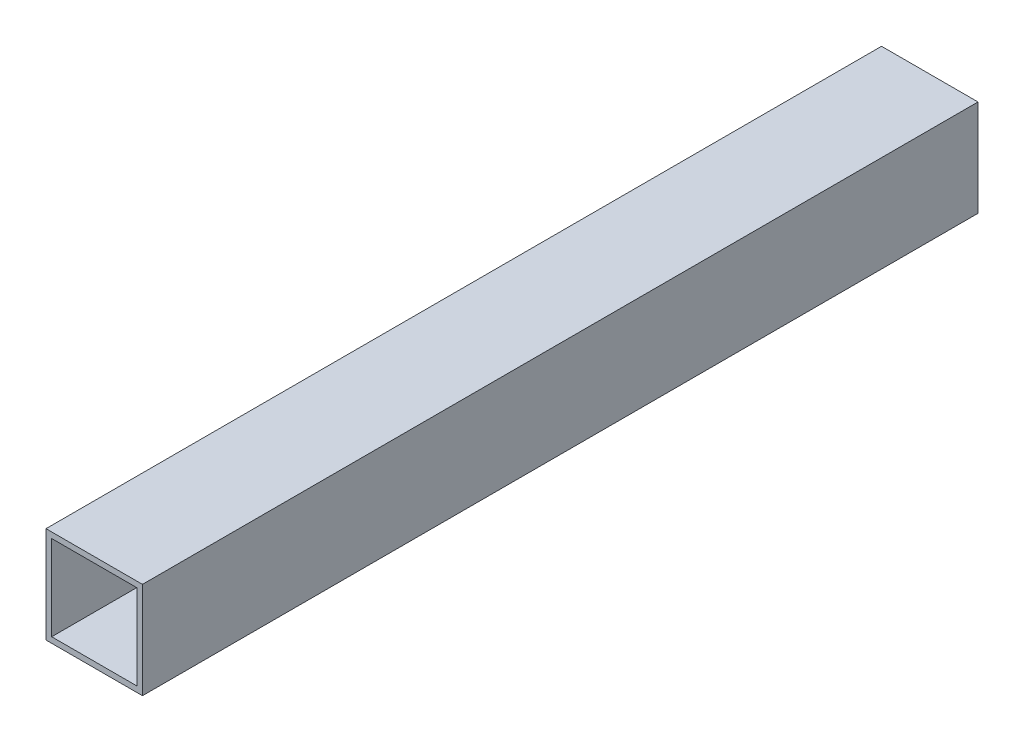
ISO-10303-21;
HEADER;
FILE_DESCRIPTION(('STEP AP214'),'2;1');
FILE_NAME('part.step','',(''),(''),'','','');
FILE_SCHEMA(('AUTOMOTIVE_DESIGN { 1 0 10303 214 1 1 1 1 }'));
ENDSEC;
DATA;
#1=APPLICATION_CONTEXT('core data for automotive mechanical design processes');
#2=APPLICATION_PROTOCOL_DEFINITION('international standard','automotive_design',2000,#1);
#3=PRODUCT_CONTEXT('',#1,'mechanical');
#4=PRODUCT('Part','Part','',(#3));
#5=PRODUCT_RELATED_PRODUCT_CATEGORY('part','',(#4));
#6=PRODUCT_DEFINITION_FORMATION('','',#4);
#7=PRODUCT_DEFINITION_CONTEXT('part definition',#1,'design');
#8=PRODUCT_DEFINITION('design','',#6,#7);
#9=PRODUCT_DEFINITION_SHAPE('','',#8);
#10=(LENGTH_UNIT() NAMED_UNIT(*) SI_UNIT(.MILLI.,.METRE.));
#11=(NAMED_UNIT(*) PLANE_ANGLE_UNIT() SI_UNIT($,.RADIAN.));
#12=(NAMED_UNIT(*) SI_UNIT($,.STERADIAN.) SOLID_ANGLE_UNIT());
#13=UNCERTAINTY_MEASURE_WITH_UNIT(LENGTH_MEASURE(1.E-05),#10,'distance_accuracy_value','');
#14=(GEOMETRIC_REPRESENTATION_CONTEXT(3) GLOBAL_UNCERTAINTY_ASSIGNED_CONTEXT((#13)) GLOBAL_UNIT_ASSIGNED_CONTEXT((#10,
#11,#12)) REPRESENTATION_CONTEXT('',''));
#15=CARTESIAN_POINT('',(0.,0.,0.));
#16=DIRECTION('',(0.,0.,1.));
#17=DIRECTION('',(1.,0.,0.));
#18=AXIS2_PLACEMENT_3D('',#15,#16,#17);
#19=CARTESIAN_POINT('',(0.,0.,220.));
#20=DIRECTION('',(0.,0.,-1.));
#21=DIRECTION('',(-1.,0.,0.));
#22=AXIS2_PLACEMENT_3D('',#19,#20,#21);
#23=PLANE('',#22);
#24=DIRECTION('',(0.,1.,0.));
#25=VECTOR('',#24,1.);
#26=CARTESIAN_POINT('',(12.7,-12.7,220.));
#27=LINE('',#26,#25);
#28=CARTESIAN_POINT('',(12.7,-12.7,220.));
#29=VERTEX_POINT('',#28);
#30=CARTESIAN_POINT('',(12.7,12.7,220.));
#31=VERTEX_POINT('',#30);
#32=EDGE_CURVE('E133',#29,#31,#27,.T.);
#33=ORIENTED_EDGE('',*,*,#32,.T.);
#34=DIRECTION('',(-1.,0.,0.));
#35=VECTOR('',#34,1.);
#36=CARTESIAN_POINT('',(-12.7,12.7,220.));
#37=LINE('',#36,#35);
#38=CARTESIAN_POINT('',(-12.7,12.7,220.));
#39=VERTEX_POINT('',#38);
#40=EDGE_CURVE('E136',#31,#39,#37,.T.);
#41=ORIENTED_EDGE('',*,*,#40,.T.);
#42=DIRECTION('',(0.,-1.,0.));
#43=VECTOR('',#42,1.);
#44=CARTESIAN_POINT('',(-12.7,-12.7,220.));
#45=LINE('',#44,#43);
#46=CARTESIAN_POINT('',(-12.7,-12.7,220.));
#47=VERTEX_POINT('',#46);
#48=EDGE_CURVE('E139',#39,#47,#45,.T.);
#49=ORIENTED_EDGE('',*,*,#48,.T.);
#50=DIRECTION('',(1.,0.,0.));
#51=VECTOR('',#50,1.);
#52=CARTESIAN_POINT('',(-12.7,-12.7,220.));
#53=LINE('',#52,#51);
#54=EDGE_CURVE('E141',#47,#29,#53,.T.);
#55=ORIENTED_EDGE('',*,*,#54,.T.);
#56=EDGE_LOOP('',(#33,#41,#49,#55));
#57=FACE_BOUND('',#56,.T.);
#58=DIRECTION('',(0.,1.,0.));
#59=VECTOR('',#58,1.);
#60=CARTESIAN_POINT('',(11.2,-11.2,220.));
#61=LINE('',#60,#59);
#62=CARTESIAN_POINT('',(11.2,-11.2,220.));
#63=VERTEX_POINT('',#62);
#64=CARTESIAN_POINT('',(11.2,11.2,220.));
#65=VERTEX_POINT('',#64);
#66=EDGE_CURVE('E97',#63,#65,#61,.T.);
#67=ORIENTED_EDGE('',*,*,#66,.F.);
#68=DIRECTION('',(1.,0.,0.));
#69=VECTOR('',#68,1.);
#70=CARTESIAN_POINT('',(-11.2,-11.2,220.));
#71=LINE('',#70,#69);
#72=CARTESIAN_POINT('',(-11.2,-11.2,220.));
#73=VERTEX_POINT('',#72);
#74=EDGE_CURVE('E119',#73,#63,#71,.T.);
#75=ORIENTED_EDGE('',*,*,#74,.F.);
#76=DIRECTION('',(0.,-1.,0.));
#77=VECTOR('',#76,1.);
#78=CARTESIAN_POINT('',(-11.2,-11.2,220.));
#79=LINE('',#78,#77);
#80=CARTESIAN_POINT('',(-11.2,11.2,220.));
#81=VERTEX_POINT('',#80);
#82=EDGE_CURVE('E117',#81,#73,#79,.T.);
#83=ORIENTED_EDGE('',*,*,#82,.F.);
#84=DIRECTION('',(-1.,0.,0.));
#85=VECTOR('',#84,1.);
#86=CARTESIAN_POINT('',(-11.2,11.2,220.));
#87=LINE('',#86,#85);
#88=EDGE_CURVE('E105',#65,#81,#87,.T.);
#89=ORIENTED_EDGE('',*,*,#88,.F.);
#90=EDGE_LOOP('',(#67,#75,#83,#89));
#91=FACE_BOUND('',#90,.T.);
#92=ADVANCED_FACE('F32',(#57,#91),#23,.F.);
#93=CARTESIAN_POINT('',(0.,0.,0.));
#94=DIRECTION('',(0.,0.,-1.));
#95=DIRECTION('',(-1.,0.,0.));
#96=AXIS2_PLACEMENT_3D('',#93,#94,#95);
#97=PLANE('',#96);
#98=DIRECTION('',(0.,1.,0.));
#99=VECTOR('',#98,1.);
#100=CARTESIAN_POINT('',(12.7,-12.7,0.));
#101=LINE('',#100,#99);
#102=CARTESIAN_POINT('',(12.7,-12.7,0.));
#103=VERTEX_POINT('',#102);
#104=CARTESIAN_POINT('',(12.7,12.7,0.));
#105=VERTEX_POINT('',#104);
#106=EDGE_CURVE('E113',#103,#105,#101,.T.);
#107=ORIENTED_EDGE('',*,*,#106,.F.);
#108=DIRECTION('',(1.,0.,0.));
#109=VECTOR('',#108,1.);
#110=CARTESIAN_POINT('',(-12.7,-12.7,0.));
#111=LINE('',#110,#109);
#112=CARTESIAN_POINT('',(-12.7,-12.7,0.));
#113=VERTEX_POINT('',#112);
#114=EDGE_CURVE('E137',#113,#103,#111,.T.);
#115=ORIENTED_EDGE('',*,*,#114,.F.);
#116=DIRECTION('',(0.,-1.,0.));
#117=VECTOR('',#116,1.);
#118=CARTESIAN_POINT('',(-12.7,-12.7,0.));
#119=LINE('',#118,#117);
#120=CARTESIAN_POINT('',(-12.7,12.7,0.));
#121=VERTEX_POINT('',#120);
#122=EDGE_CURVE('E148',#121,#113,#119,.T.);
#123=ORIENTED_EDGE('',*,*,#122,.F.);
#124=DIRECTION('',(-1.,0.,0.));
#125=VECTOR('',#124,1.);
#126=CARTESIAN_POINT('',(-12.7,12.7,0.));
#127=LINE('',#126,#125);
#128=EDGE_CURVE('E146',#105,#121,#127,.T.);
#129=ORIENTED_EDGE('',*,*,#128,.F.);
#130=EDGE_LOOP('',(#107,#115,#123,#129));
#131=FACE_BOUND('',#130,.T.);
#132=DIRECTION('',(1.,0.,0.));
#133=VECTOR('',#132,1.);
#134=CARTESIAN_POINT('',(-11.2,-11.2,0.));
#135=LINE('',#134,#133);
#136=CARTESIAN_POINT('',(-11.2,-11.2,0.));
#137=VERTEX_POINT('',#136);
#138=CARTESIAN_POINT('',(11.2,-11.2,0.));
#139=VERTEX_POINT('',#138);
#140=EDGE_CURVE('E106',#137,#139,#135,.T.);
#141=ORIENTED_EDGE('',*,*,#140,.T.);
#142=DIRECTION('',(0.,1.,0.));
#143=VECTOR('',#142,1.);
#144=CARTESIAN_POINT('',(11.2,-11.2,0.));
#145=LINE('',#144,#143);
#146=CARTESIAN_POINT('',(11.2,11.2,0.));
#147=VERTEX_POINT('',#146);
#148=EDGE_CURVE('E55',#139,#147,#145,.T.);
#149=ORIENTED_EDGE('',*,*,#148,.T.);
#150=DIRECTION('',(-1.,0.,0.));
#151=VECTOR('',#150,1.);
#152=CARTESIAN_POINT('',(-11.2,11.2,0.));
#153=LINE('',#152,#151);
#154=CARTESIAN_POINT('',(-11.2,11.2,0.));
#155=VERTEX_POINT('',#154);
#156=EDGE_CURVE('E112',#147,#155,#153,.T.);
#157=ORIENTED_EDGE('',*,*,#156,.T.);
#158=DIRECTION('',(0.,-1.,0.));
#159=VECTOR('',#158,1.);
#160=CARTESIAN_POINT('',(-11.2,-11.2,0.));
#161=LINE('',#160,#159);
#162=EDGE_CURVE('E125',#155,#137,#161,.T.);
#163=ORIENTED_EDGE('',*,*,#162,.T.);
#164=EDGE_LOOP('',(#141,#149,#157,#163));
#165=FACE_BOUND('',#164,.T.);
#166=ADVANCED_FACE('F166',(#131,#165),#97,.T.);
#167=CARTESIAN_POINT('',(12.7,-12.7,220.));
#168=DIRECTION('',(-1.,0.,0.));
#169=DIRECTION('',(0.,0.,1.));
#170=AXIS2_PLACEMENT_3D('',#167,#168,#169);
#171=PLANE('',#170);
#172=ORIENTED_EDGE('',*,*,#106,.T.);
#173=DIRECTION('',(0.,0.,-1.));
#174=VECTOR('',#173,1.);
#175=CARTESIAN_POINT('',(12.7,12.7,220.));
#176=LINE('',#175,#174);
#177=EDGE_CURVE('E11',#31,#105,#176,.T.);
#178=ORIENTED_EDGE('',*,*,#177,.F.);
#179=ORIENTED_EDGE('',*,*,#32,.F.);
#180=DIRECTION('',(0.,0.,-1.));
#181=VECTOR('',#180,1.);
#182=CARTESIAN_POINT('',(12.7,-12.7,220.));
#183=LINE('',#182,#181);
#184=EDGE_CURVE('E143',#29,#103,#183,.T.);
#185=ORIENTED_EDGE('',*,*,#184,.T.);
#186=EDGE_LOOP('',(#172,#178,#179,#185));
#187=FACE_BOUND('',#186,.T.);
#188=ADVANCED_FACE('F34',(#187),#171,.F.);
#189=CARTESIAN_POINT('',(-12.7,12.7,220.));
#190=DIRECTION('',(0.,-1.,0.));
#191=DIRECTION('',(1.,0.,0.));
#192=AXIS2_PLACEMENT_3D('',#189,#190,#191);
#193=PLANE('',#192);
#194=ORIENTED_EDGE('',*,*,#128,.T.);
#195=DIRECTION('',(0.,0.,-1.));
#196=VECTOR('',#195,1.);
#197=CARTESIAN_POINT('',(-12.7,12.7,220.));
#198=LINE('',#197,#196);
#199=EDGE_CURVE('E40',#39,#121,#198,.T.);
#200=ORIENTED_EDGE('',*,*,#199,.F.);
#201=ORIENTED_EDGE('',*,*,#40,.F.);
#202=ORIENTED_EDGE('',*,*,#177,.T.);
#203=EDGE_LOOP('',(#194,#200,#201,#202));
#204=FACE_BOUND('',#203,.T.);
#205=ADVANCED_FACE('F176',(#204),#193,.F.);
#206=CARTESIAN_POINT('',(-12.7,-12.7,220.));
#207=DIRECTION('',(1.,0.,0.));
#208=DIRECTION('',(0.,0.,-1.));
#209=AXIS2_PLACEMENT_3D('',#206,#207,#208);
#210=PLANE('',#209);
#211=ORIENTED_EDGE('',*,*,#122,.T.);
#212=DIRECTION('',(0.,0.,-1.));
#213=VECTOR('',#212,1.);
#214=CARTESIAN_POINT('',(-12.7,-12.7,220.));
#215=LINE('',#214,#213);
#216=EDGE_CURVE('E153',#47,#113,#215,.T.);
#217=ORIENTED_EDGE('',*,*,#216,.F.);
#218=ORIENTED_EDGE('',*,*,#48,.F.);
#219=ORIENTED_EDGE('',*,*,#199,.T.);
#220=EDGE_LOOP('',(#211,#217,#218,#219));
#221=FACE_BOUND('',#220,.T.);
#222=ADVANCED_FACE('F160',(#221),#210,.F.);
#223=CARTESIAN_POINT('',(-12.7,-12.7,220.));
#224=DIRECTION('',(0.,1.,0.));
#225=DIRECTION('',(-1.,0.,0.));
#226=AXIS2_PLACEMENT_3D('',#223,#224,#225);
#227=PLANE('',#226);
#228=ORIENTED_EDGE('',*,*,#114,.T.);
#229=ORIENTED_EDGE('',*,*,#184,.F.);
#230=ORIENTED_EDGE('',*,*,#54,.F.);
#231=ORIENTED_EDGE('',*,*,#216,.T.);
#232=EDGE_LOOP('',(#228,#229,#230,#231));
#233=FACE_BOUND('',#232,.T.);
#234=ADVANCED_FACE('F170',(#233),#227,.F.);
#235=CARTESIAN_POINT('',(11.2,-11.2,220.));
#236=DIRECTION('',(-1.,0.,0.));
#237=DIRECTION('',(0.,0.,1.));
#238=AXIS2_PLACEMENT_3D('',#235,#236,#237);
#239=PLANE('',#238);
#240=ORIENTED_EDGE('',*,*,#148,.F.);
#241=DIRECTION('',(0.,0.,-1.));
#242=VECTOR('',#241,1.);
#243=CARTESIAN_POINT('',(11.2,-11.2,220.));
#244=LINE('',#243,#242);
#245=EDGE_CURVE('E101',#63,#139,#244,.T.);
#246=ORIENTED_EDGE('',*,*,#245,.F.);
#247=ORIENTED_EDGE('',*,*,#66,.T.);
#248=DIRECTION('',(0.,0.,-1.));
#249=VECTOR('',#248,1.);
#250=CARTESIAN_POINT('',(11.2,11.2,220.));
#251=LINE('',#250,#249);
#252=EDGE_CURVE('E100',#65,#147,#251,.T.);
#253=ORIENTED_EDGE('',*,*,#252,.T.);
#254=EDGE_LOOP('',(#240,#246,#247,#253));
#255=FACE_BOUND('',#254,.T.);
#256=ADVANCED_FACE('F99',(#255),#239,.T.);
#257=CARTESIAN_POINT('',(-11.2,11.2,220.));
#258=DIRECTION('',(0.,-1.,0.));
#259=DIRECTION('',(0.,0.,-1.));
#260=AXIS2_PLACEMENT_3D('',#257,#258,#259);
#261=PLANE('',#260);
#262=ORIENTED_EDGE('',*,*,#156,.F.);
#263=ORIENTED_EDGE('',*,*,#252,.F.);
#264=ORIENTED_EDGE('',*,*,#88,.T.);
#265=DIRECTION('',(0.,0.,-1.));
#266=VECTOR('',#265,1.);
#267=CARTESIAN_POINT('',(-11.2,11.2,220.));
#268=LINE('',#267,#266);
#269=EDGE_CURVE('E114',#81,#155,#268,.T.);
#270=ORIENTED_EDGE('',*,*,#269,.T.);
#271=EDGE_LOOP('',(#262,#263,#264,#270));
#272=FACE_BOUND('',#271,.T.);
#273=ADVANCED_FACE('F109',(#272),#261,.T.);
#274=CARTESIAN_POINT('',(-11.2,-11.2,220.));
#275=DIRECTION('',(1.,0.,0.));
#276=DIRECTION('',(0.,0.,-1.));
#277=AXIS2_PLACEMENT_3D('',#274,#275,#276);
#278=PLANE('',#277);
#279=ORIENTED_EDGE('',*,*,#162,.F.);
#280=ORIENTED_EDGE('',*,*,#269,.F.);
#281=ORIENTED_EDGE('',*,*,#82,.T.);
#282=DIRECTION('',(0.,0.,-1.));
#283=VECTOR('',#282,1.);
#284=CARTESIAN_POINT('',(-11.2,-11.2,220.));
#285=LINE('',#284,#283);
#286=EDGE_CURVE('E47',#73,#137,#285,.T.);
#287=ORIENTED_EDGE('',*,*,#286,.T.);
#288=EDGE_LOOP('',(#279,#280,#281,#287));
#289=FACE_BOUND('',#288,.T.);
#290=ADVANCED_FACE('F199',(#289),#278,.T.);
#291=CARTESIAN_POINT('',(-11.2,-11.2,220.));
#292=DIRECTION('',(0.,1.,0.));
#293=DIRECTION('',(0.,0.,1.));
#294=AXIS2_PLACEMENT_3D('',#291,#292,#293);
#295=PLANE('',#294);
#296=ORIENTED_EDGE('',*,*,#140,.F.);
#297=ORIENTED_EDGE('',*,*,#286,.F.);
#298=ORIENTED_EDGE('',*,*,#74,.T.);
#299=ORIENTED_EDGE('',*,*,#245,.T.);
#300=EDGE_LOOP('',(#296,#297,#298,#299));
#301=FACE_BOUND('',#300,.T.);
#302=ADVANCED_FACE('F203',(#301),#295,.T.);
#303=CLOSED_SHELL('',(#92,#166,#188,#205,#222,#234,#256,#273,#290,#302));
#304=MANIFOLD_SOLID_BREP('B2',#303);
#305=ADVANCED_BREP_SHAPE_REPRESENTATION('',(#18,#304),#14);
#306=SHAPE_DEFINITION_REPRESENTATION(#9,#305);
ENDSEC;
END-ISO-10303-21;
